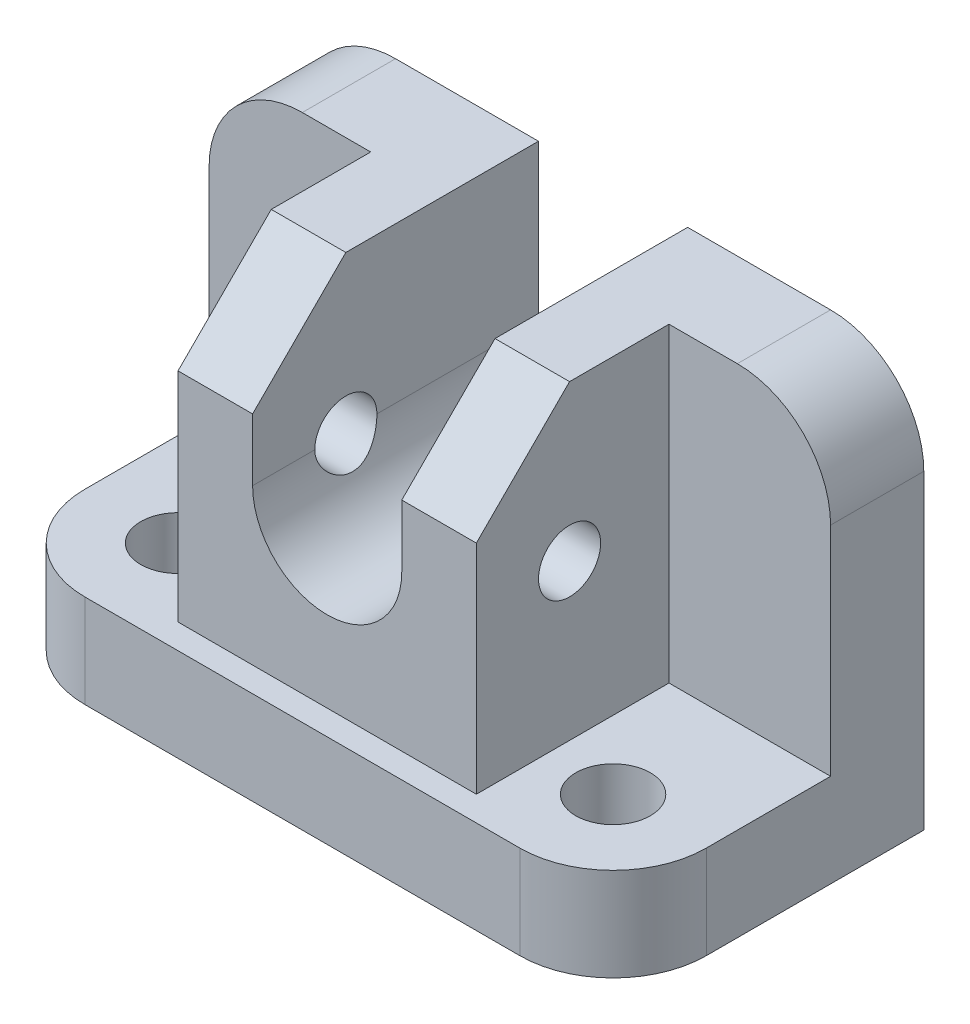
ISO-10303-21;
HEADER;
FILE_DESCRIPTION(('STEP AP214'),'2;1');
FILE_NAME('part.step','',(''),(''),'','','');
FILE_SCHEMA(('AUTOMOTIVE_DESIGN { 1 0 10303 214 1 1 1 1 }'));
ENDSEC;
DATA;
#1=APPLICATION_CONTEXT('core data for automotive mechanical design processes');
#2=APPLICATION_PROTOCOL_DEFINITION('international standard','automotive_design',2000,#1);
#3=PRODUCT_CONTEXT('',#1,'mechanical');
#4=PRODUCT('Part','Part','',(#3));
#5=PRODUCT_RELATED_PRODUCT_CATEGORY('part','',(#4));
#6=PRODUCT_DEFINITION_FORMATION('','',#4);
#7=PRODUCT_DEFINITION_CONTEXT('part definition',#1,'design');
#8=PRODUCT_DEFINITION('design','',#6,#7);
#9=PRODUCT_DEFINITION_SHAPE('','',#8);
#10=(LENGTH_UNIT() NAMED_UNIT(*) SI_UNIT(.MILLI.,.METRE.));
#11=(NAMED_UNIT(*) PLANE_ANGLE_UNIT() SI_UNIT($,.RADIAN.));
#12=(NAMED_UNIT(*) SI_UNIT($,.STERADIAN.) SOLID_ANGLE_UNIT());
#13=UNCERTAINTY_MEASURE_WITH_UNIT(LENGTH_MEASURE(1.E-05),#10,'distance_accuracy_value','');
#14=(GEOMETRIC_REPRESENTATION_CONTEXT(3) GLOBAL_UNCERTAINTY_ASSIGNED_CONTEXT((#13)) GLOBAL_UNIT_ASSIGNED_CONTEXT((#10,
#11,#12)) REPRESENTATION_CONTEXT('',''));
#15=CARTESIAN_POINT('',(0.,0.,0.));
#16=DIRECTION('',(0.,0.,1.));
#17=DIRECTION('',(1.,0.,0.));
#18=AXIS2_PLACEMENT_3D('',#15,#16,#17);
#19=CARTESIAN_POINT('',(0.,0.,46.));
#20=DIRECTION('',(0.,0.,-1.));
#21=DIRECTION('',(-1.,0.,0.));
#22=AXIS2_PLACEMENT_3D('',#19,#20,#21);
#23=PLANE('',#22);
#24=DIRECTION('',(0.,1.,0.));
#25=VECTOR('',#24,1.);
#26=CARTESIAN_POINT('',(24.,15.,46.));
#27=LINE('',#26,#25);
#28=CARTESIAN_POINT('',(24.,15.,46.));
#29=VERTEX_POINT('',#28);
#30=CARTESIAN_POINT('',(24.,50.,46.));
#31=VERTEX_POINT('',#30);
#32=EDGE_CURVE('E557',#29,#31,#27,.T.);
#33=ORIENTED_EDGE('',*,*,#32,.T.);
#34=DIRECTION('',(-1.,0.,0.));
#35=VECTOR('',#34,1.);
#36=CARTESIAN_POINT('',(50.,50.,46.));
#37=LINE('',#36,#35);
#38=CARTESIAN_POINT('',(12.,50.,46.));
#39=VERTEX_POINT('',#38);
#40=EDGE_CURVE('E509',#31,#39,#37,.T.);
#41=ORIENTED_EDGE('',*,*,#40,.T.);
#42=DIRECTION('',(0.,1.,0.));
#43=VECTOR('',#42,1.);
#44=CARTESIAN_POINT('',(12.,65.,46.));
#45=LINE('',#44,#43);
#46=CARTESIAN_POINT('',(12.,40.,46.));
#47=VERTEX_POINT('',#46);
#48=EDGE_CURVE('E529',#47,#39,#45,.T.);
#49=ORIENTED_EDGE('',*,*,#48,.F.);
#50=CARTESIAN_POINT('',(0.,40.,46.));
#51=DIRECTION('',(0.,0.,1.));
#52=DIRECTION('',(-1.,0.,0.));
#53=AXIS2_PLACEMENT_3D('',#50,#51,#52);
#54=CIRCLE('',#53,12.);
#55=CARTESIAN_POINT('',(-12.,40.,46.));
#56=VERTEX_POINT('',#55);
#57=EDGE_CURVE('E538',#56,#47,#54,.T.);
#58=ORIENTED_EDGE('',*,*,#57,.F.);
#59=DIRECTION('',(0.,-1.,0.));
#60=VECTOR('',#59,1.);
#61=CARTESIAN_POINT('',(-12.,65.,46.));
#62=LINE('',#61,#60);
#63=CARTESIAN_POINT('',(-12.,50.,46.));
#64=VERTEX_POINT('',#63);
#65=EDGE_CURVE('E209',#64,#56,#62,.T.);
#66=ORIENTED_EDGE('',*,*,#65,.F.);
#67=DIRECTION('',(1.,0.,0.));
#68=VECTOR('',#67,1.);
#69=CARTESIAN_POINT('',(-50.,50.,46.));
#70=LINE('',#69,#68);
#71=CARTESIAN_POINT('',(-24.,50.,46.));
#72=VERTEX_POINT('',#71);
#73=EDGE_CURVE('E518',#72,#64,#70,.T.);
#74=ORIENTED_EDGE('',*,*,#73,.F.);
#75=DIRECTION('',(0.,1.,0.));
#76=VECTOR('',#75,1.);
#77=CARTESIAN_POINT('',(-24.,15.,46.));
#78=LINE('',#77,#76);
#79=CARTESIAN_POINT('',(-24.,15.,46.));
#80=VERTEX_POINT('',#79);
#81=EDGE_CURVE('E489',#80,#72,#78,.T.);
#82=ORIENTED_EDGE('',*,*,#81,.F.);
#83=DIRECTION('',(1.,0.,0.));
#84=VECTOR('',#83,1.);
#85=CARTESIAN_POINT('',(0.,15.,46.));
#86=LINE('',#85,#84);
#87=EDGE_CURVE('E227',#80,#29,#86,.T.);
#88=ORIENTED_EDGE('',*,*,#87,.T.);
#89=EDGE_LOOP('',(#33,#41,#49,#58,#66,#74,#82,#88));
#90=FACE_BOUND('',#89,.T.);
#91=ADVANCED_FACE('F39',(#90),#23,.F.);
#92=CARTESIAN_POINT('',(-50.,65.,46.));
#93=DIRECTION('',(0.,-1.,0.));
#94=DIRECTION('',(0.,0.,-1.));
#95=AXIS2_PLACEMENT_3D('',#92,#93,#94);
#96=PLANE('',#95);
#97=DIRECTION('',(1.,0.,0.));
#98=VECTOR('',#97,1.);
#99=CARTESIAN_POINT('',(24.,65.,15.));
#100=LINE('',#99,#98);
#101=CARTESIAN_POINT('',(24.,65.,15.));
#102=VERTEX_POINT('',#101);
#103=CARTESIAN_POINT('',(35.,65.,15.));
#104=VERTEX_POINT('',#103);
#105=EDGE_CURVE('E468',#102,#104,#100,.T.);
#106=ORIENTED_EDGE('',*,*,#105,.T.);
#107=DIRECTION('',(0.,0.,-1.));
#108=VECTOR('',#107,1.);
#109=CARTESIAN_POINT('',(35.,65.,46.));
#110=LINE('',#109,#108);
#111=CARTESIAN_POINT('',(35.,65.,0.));
#112=VERTEX_POINT('',#111);
#113=EDGE_CURVE('E291',#104,#112,#110,.T.);
#114=ORIENTED_EDGE('',*,*,#113,.T.);
#115=DIRECTION('',(-1.,0.,0.));
#116=VECTOR('',#115,1.);
#117=CARTESIAN_POINT('',(-50.,65.,0.));
#118=LINE('',#117,#116);
#119=CARTESIAN_POINT('',(12.,65.,0.));
#120=VERTEX_POINT('',#119);
#121=EDGE_CURVE('E224',#112,#120,#118,.T.);
#122=ORIENTED_EDGE('',*,*,#121,.T.);
#123=DIRECTION('',(0.,0.,1.));
#124=VECTOR('',#123,1.);
#125=CARTESIAN_POINT('',(12.,65.,0.));
#126=LINE('',#125,#124);
#127=CARTESIAN_POINT('',(12.,65.,31.));
#128=VERTEX_POINT('',#127);
#129=EDGE_CURVE('E543',#120,#128,#126,.T.);
#130=ORIENTED_EDGE('',*,*,#129,.T.);
#131=DIRECTION('',(-1.,0.,0.));
#132=VECTOR('',#131,1.);
#133=CARTESIAN_POINT('',(50.,65.,31.));
#134=LINE('',#133,#132);
#135=CARTESIAN_POINT('',(24.,65.,31.));
#136=VERTEX_POINT('',#135);
#137=EDGE_CURVE('E508',#136,#128,#134,.T.);
#138=ORIENTED_EDGE('',*,*,#137,.F.);
#139=DIRECTION('',(0.,0.,-1.));
#140=VECTOR('',#139,1.);
#141=CARTESIAN_POINT('',(24.,65.,31.));
#142=LINE('',#141,#140);
#143=EDGE_CURVE('E461',#136,#102,#142,.T.);
#144=ORIENTED_EDGE('',*,*,#143,.T.);
#145=EDGE_LOOP('',(#106,#114,#122,#130,#138,#144));
#146=FACE_BOUND('',#145,.T.);
#147=ADVANCED_FACE('F395',(#146),#96,.F.);
#148=CARTESIAN_POINT('',(50.,15.,0.));
#149=DIRECTION('',(-1.,0.,0.));
#150=DIRECTION('',(0.,0.,1.));
#151=AXIS2_PLACEMENT_3D('',#148,#149,#150);
#152=PLANE('',#151);
#153=DIRECTION('',(0.,0.,-1.));
#154=VECTOR('',#153,1.);
#155=CARTESIAN_POINT('',(50.,15.,0.));
#156=LINE('',#155,#154);
#157=CARTESIAN_POINT('',(50.,15.,35.));
#158=VERTEX_POINT('',#157);
#159=CARTESIAN_POINT('',(50.,15.,15.));
#160=VERTEX_POINT('',#159);
#161=EDGE_CURVE('E242',#158,#160,#156,.T.);
#162=ORIENTED_EDGE('',*,*,#161,.F.);
#163=DIRECTION('',(0.,-1.,0.));
#164=VECTOR('',#163,1.);
#165=CARTESIAN_POINT('',(50.,15.,35.));
#166=LINE('',#165,#164);
#167=CARTESIAN_POINT('',(50.,0.,35.));
#168=VERTEX_POINT('',#167);
#169=EDGE_CURVE('E268',#158,#168,#166,.T.);
#170=ORIENTED_EDGE('',*,*,#169,.T.);
#171=DIRECTION('',(0.,0.,-1.));
#172=VECTOR('',#171,1.);
#173=CARTESIAN_POINT('',(50.,0.,0.));
#174=LINE('',#173,#172);
#175=CARTESIAN_POINT('',(50.,0.,0.));
#176=VERTEX_POINT('',#175);
#177=EDGE_CURVE('E253',#168,#176,#174,.T.);
#178=ORIENTED_EDGE('',*,*,#177,.T.);
#179=DIRECTION('',(0.,-1.,0.));
#180=VECTOR('',#179,1.);
#181=CARTESIAN_POINT('',(50.,15.,0.));
#182=LINE('',#181,#180);
#183=CARTESIAN_POINT('',(50.,50.,0.));
#184=VERTEX_POINT('',#183);
#185=EDGE_CURVE('E262',#184,#176,#182,.T.);
#186=ORIENTED_EDGE('',*,*,#185,.F.);
#187=DIRECTION('',(0.,0.,-1.));
#188=VECTOR('',#187,1.);
#189=CARTESIAN_POINT('',(50.,50.,0.));
#190=LINE('',#189,#188);
#191=CARTESIAN_POINT('',(50.,50.,15.));
#192=VERTEX_POINT('',#191);
#193=EDGE_CURVE('E265',#184,#192,#190,.F.);
#194=ORIENTED_EDGE('',*,*,#193,.T.);
#195=DIRECTION('',(0.,-1.,0.));
#196=VECTOR('',#195,1.);
#197=CARTESIAN_POINT('',(50.,65.,15.));
#198=LINE('',#197,#196);
#199=EDGE_CURVE('E455',#192,#160,#198,.T.);
#200=ORIENTED_EDGE('',*,*,#199,.T.);
#201=EDGE_LOOP('',(#162,#170,#178,#186,#194,#200));
#202=FACE_BOUND('',#201,.T.);
#203=ADVANCED_FACE('F379',(#202),#152,.F.);
#204=CARTESIAN_POINT('',(50.,65.,31.));
#205=DIRECTION('',(0.,0.707106781186548,0.707106781186548));
#206=DIRECTION('',(0.,-0.707106781186548,0.707106781186548));
#207=AXIS2_PLACEMENT_3D('',#204,#205,#206);
#208=PLANE('',#207);
#209=ORIENTED_EDGE('',*,*,#40,.F.);
#210=DIRECTION('',(0.,0.707106781186548,-0.707106781186547));
#211=VECTOR('',#210,1.);
#212=CARTESIAN_POINT('',(24.,50.,46.));
#213=LINE('',#212,#211);
#214=EDGE_CURVE('E567',#31,#136,#213,.T.);
#215=ORIENTED_EDGE('',*,*,#214,.T.);
#216=ORIENTED_EDGE('',*,*,#137,.T.);
#217=DIRECTION('',(0.,0.707106781186547,-0.707106781186547));
#218=VECTOR('',#217,1.);
#219=CARTESIAN_POINT('',(12.,65.,31.));
#220=LINE('',#219,#218);
#221=EDGE_CURVE('E501',#39,#128,#220,.T.);
#222=ORIENTED_EDGE('',*,*,#221,.F.);
#223=EDGE_LOOP('',(#209,#215,#216,#222));
#224=FACE_BOUND('',#223,.T.);
#225=ADVANCED_FACE('F375',(#224),#208,.T.);
#226=CARTESIAN_POINT('',(-50.,65.,31.));
#227=DIRECTION('',(0.,-0.707106781186548,-0.707106781186548));
#228=DIRECTION('',(0.,0.707106781186548,-0.707106781186548));
#229=AXIS2_PLACEMENT_3D('',#226,#227,#228);
#230=PLANE('',#229);
#231=DIRECTION('',(0.,0.707106781186548,-0.707106781186547));
#232=VECTOR('',#231,1.);
#233=CARTESIAN_POINT('',(-24.,50.,46.));
#234=LINE('',#233,#232);
#235=CARTESIAN_POINT('',(-24.,65.,31.));
#236=VERTEX_POINT('',#235);
#237=EDGE_CURVE('E492',#72,#236,#234,.T.);
#238=ORIENTED_EDGE('',*,*,#237,.F.);
#239=ORIENTED_EDGE('',*,*,#73,.T.);
#240=DIRECTION('',(0.,0.707106781186547,-0.707106781186547));
#241=VECTOR('',#240,1.);
#242=CARTESIAN_POINT('',(-12.,65.,31.));
#243=LINE('',#242,#241);
#244=CARTESIAN_POINT('',(-12.,65.,31.));
#245=VERTEX_POINT('',#244);
#246=EDGE_CURVE('E512',#64,#245,#243,.T.);
#247=ORIENTED_EDGE('',*,*,#246,.T.);
#248=DIRECTION('',(1.,0.,0.));
#249=VECTOR('',#248,1.);
#250=CARTESIAN_POINT('',(-50.,65.,31.));
#251=LINE('',#250,#249);
#252=EDGE_CURVE('E519',#236,#245,#251,.T.);
#253=ORIENTED_EDGE('',*,*,#252,.F.);
#254=EDGE_LOOP('',(#238,#239,#247,#253));
#255=FACE_BOUND('',#254,.T.);
#256=ADVANCED_FACE('F378',(#255),#230,.F.);
#257=CARTESIAN_POINT('',(12.,65.,0.));
#258=DIRECTION('',(1.,0.,0.));
#259=DIRECTION('',(0.,1.,0.));
#260=AXIS2_PLACEMENT_3D('',#257,#258,#259);
#261=PLANE('',#260);
#262=DIRECTION('',(0.,0.,1.));
#263=VECTOR('',#262,1.);
#264=CARTESIAN_POINT('',(12.,40.,0.));
#265=LINE('',#264,#263);
#266=CARTESIAN_POINT('',(12.,40.,0.));
#267=VERTEX_POINT('',#266);
#268=CARTESIAN_POINT('',(12.,40.,26.));
#269=VERTEX_POINT('',#268);
#270=EDGE_CURVE('E221',#267,#269,#265,.T.);
#271=ORIENTED_EDGE('',*,*,#270,.T.);
#272=CARTESIAN_POINT('',(12.,40.,31.));
#273=DIRECTION('',(1.,0.,0.));
#274=DIRECTION('',(0.,1.,0.));
#275=AXIS2_PLACEMENT_3D('',#272,#273,#274);
#276=CIRCLE('',#275,5.);
#277=CARTESIAN_POINT('',(12.,40.,36.));
#278=VERTEX_POINT('',#277);
#279=EDGE_CURVE('E56',#269,#278,#276,.T.);
#280=ORIENTED_EDGE('',*,*,#279,.T.);
#281=EDGE_CURVE('E216',#278,#47,#265,.T.);
#282=ORIENTED_EDGE('',*,*,#281,.T.);
#283=ORIENTED_EDGE('',*,*,#48,.T.);
#284=ORIENTED_EDGE('',*,*,#221,.T.);
#285=ORIENTED_EDGE('',*,*,#129,.F.);
#286=DIRECTION('',(0.,1.,0.));
#287=VECTOR('',#286,1.);
#288=CARTESIAN_POINT('',(12.,65.,0.));
#289=LINE('',#288,#287);
#290=EDGE_CURVE('E218',#267,#120,#289,.T.);
#291=ORIENTED_EDGE('',*,*,#290,.F.);
#292=EDGE_LOOP('',(#271,#280,#282,#283,#284,#285,#291));
#293=FACE_BOUND('',#292,.T.);
#294=ADVANCED_FACE('F382',(#293),#261,.F.);
#295=CARTESIAN_POINT('',(0.,15.,0.));
#296=DIRECTION('',(0.,-1.,0.));
#297=DIRECTION('',(0.,0.,-1.));
#298=AXIS2_PLACEMENT_3D('',#295,#296,#297);
#299=PLANE('',#298);
#300=CARTESIAN_POINT('',(35.,15.,35.));
#301=DIRECTION('',(0.,-1.,0.));
#302=DIRECTION('',(0.,0.,1.));
#303=AXIS2_PLACEMENT_3D('',#300,#301,#302);
#304=CIRCLE('',#303,6.);
#305=CARTESIAN_POINT('',(35.,15.,41.));
#306=VERTEX_POINT('',#305);
#307=EDGE_CURVE('E329',#306,#306,#304,.T.);
#308=ORIENTED_EDGE('',*,*,#307,.T.);
#309=EDGE_LOOP('',(#308));
#310=FACE_BOUND('',#309,.T.);
#311=CARTESIAN_POINT('',(-35.,15.,35.));
#312=DIRECTION('',(0.,1.,0.));
#313=DIRECTION('',(0.,0.,1.));
#314=AXIS2_PLACEMENT_3D('',#311,#312,#313);
#315=CIRCLE('',#314,6.);
#316=CARTESIAN_POINT('',(-35.,15.,41.));
#317=VERTEX_POINT('',#316);
#318=EDGE_CURVE('E316',#317,#317,#315,.T.);
#319=ORIENTED_EDGE('',*,*,#318,.F.);
#320=EDGE_LOOP('',(#319));
#321=FACE_BOUND('',#320,.T.);
#322=DIRECTION('',(1.,0.,0.));
#323=VECTOR('',#322,1.);
#324=CARTESIAN_POINT('',(50.,15.,50.));
#325=LINE('',#324,#323);
#326=CARTESIAN_POINT('',(-35.,15.,50.));
#327=VERTEX_POINT('',#326);
#328=CARTESIAN_POINT('',(35.,15.,50.));
#329=VERTEX_POINT('',#328);
#330=EDGE_CURVE('E237',#327,#329,#325,.T.);
#331=ORIENTED_EDGE('',*,*,#330,.T.);
#332=CARTESIAN_POINT('',(35.,15.,35.));
#333=DIRECTION('',(0.,-1.,0.));
#334=DIRECTION('',(0.,0.,-1.));
#335=AXIS2_PLACEMENT_3D('',#332,#333,#334);
#336=CIRCLE('',#335,15.);
#337=EDGE_CURVE('E288',#329,#158,#336,.F.);
#338=ORIENTED_EDGE('',*,*,#337,.T.);
#339=ORIENTED_EDGE('',*,*,#161,.T.);
#340=DIRECTION('',(1.,0.,0.));
#341=VECTOR('',#340,1.);
#342=CARTESIAN_POINT('',(24.,15.,15.));
#343=LINE('',#342,#341);
#344=CARTESIAN_POINT('',(24.,15.,15.));
#345=VERTEX_POINT('',#344);
#346=EDGE_CURVE('E463',#345,#160,#343,.T.);
#347=ORIENTED_EDGE('',*,*,#346,.F.);
#348=DIRECTION('',(0.,0.,1.));
#349=VECTOR('',#348,1.);
#350=CARTESIAN_POINT('',(24.,15.,15.));
#351=LINE('',#350,#349);
#352=EDGE_CURVE('E475',#345,#29,#351,.T.);
#353=ORIENTED_EDGE('',*,*,#352,.T.);
#354=ORIENTED_EDGE('',*,*,#87,.F.);
#355=DIRECTION('',(0.,0.,1.));
#356=VECTOR('',#355,1.);
#357=CARTESIAN_POINT('',(-24.,15.,15.));
#358=LINE('',#357,#356);
#359=CARTESIAN_POINT('',(-24.,15.,15.));
#360=VERTEX_POINT('',#359);
#361=EDGE_CURVE('E486',#360,#80,#358,.T.);
#362=ORIENTED_EDGE('',*,*,#361,.F.);
#363=DIRECTION('',(-1.,0.,0.));
#364=VECTOR('',#363,1.);
#365=CARTESIAN_POINT('',(-24.,15.,15.));
#366=LINE('',#365,#364);
#367=CARTESIAN_POINT('',(-50.,15.,15.));
#368=VERTEX_POINT('',#367);
#369=EDGE_CURVE('E498',#360,#368,#366,.T.);
#370=ORIENTED_EDGE('',*,*,#369,.T.);
#371=DIRECTION('',(0.,0.,1.));
#372=VECTOR('',#371,1.);
#373=CARTESIAN_POINT('',(-50.,15.,50.));
#374=LINE('',#373,#372);
#375=CARTESIAN_POINT('',(-50.,15.,35.));
#376=VERTEX_POINT('',#375);
#377=EDGE_CURVE('E233',#368,#376,#374,.T.);
#378=ORIENTED_EDGE('',*,*,#377,.T.);
#379=CARTESIAN_POINT('',(-35.,15.,35.));
#380=DIRECTION('',(0.,-1.,0.));
#381=DIRECTION('',(0.,0.,-1.));
#382=AXIS2_PLACEMENT_3D('',#379,#380,#381);
#383=CIRCLE('',#382,15.);
#384=EDGE_CURVE('E285',#376,#327,#383,.F.);
#385=ORIENTED_EDGE('',*,*,#384,.T.);
#386=EDGE_LOOP('',(#331,#338,#339,#347,#353,#354,#362,#370,#378,#385));
#387=FACE_BOUND('',#386,.T.);
#388=ADVANCED_FACE('F385',(#310,#321,#387),#299,.F.);
#389=CARTESIAN_POINT('',(-50.,15.,50.));
#390=DIRECTION('',(1.,0.,0.));
#391=DIRECTION('',(0.,0.,-1.));
#392=AXIS2_PLACEMENT_3D('',#389,#390,#391);
#393=PLANE('',#392);
#394=DIRECTION('',(0.,0.,1.));
#395=VECTOR('',#394,1.);
#396=CARTESIAN_POINT('',(-50.,0.,50.));
#397=LINE('',#396,#395);
#398=CARTESIAN_POINT('',(-50.,0.,0.));
#399=VERTEX_POINT('',#398);
#400=CARTESIAN_POINT('',(-50.,0.,35.));
#401=VERTEX_POINT('',#400);
#402=EDGE_CURVE('E232',#399,#401,#397,.T.);
#403=ORIENTED_EDGE('',*,*,#402,.T.);
#404=DIRECTION('',(0.,-1.,0.));
#405=VECTOR('',#404,1.);
#406=CARTESIAN_POINT('',(-50.,15.,35.));
#407=LINE('',#406,#405);
#408=EDGE_CURVE('E308',#401,#376,#407,.F.);
#409=ORIENTED_EDGE('',*,*,#408,.T.);
#410=ORIENTED_EDGE('',*,*,#377,.F.);
#411=DIRECTION('',(0.,-1.,0.));
#412=VECTOR('',#411,1.);
#413=CARTESIAN_POINT('',(-50.,65.,15.));
#414=LINE('',#413,#412);
#415=CARTESIAN_POINT('',(-50.,50.,15.));
#416=VERTEX_POINT('',#415);
#417=EDGE_CURVE('E473',#416,#368,#414,.T.);
#418=ORIENTED_EDGE('',*,*,#417,.F.);
#419=DIRECTION('',(0.,0.,-1.));
#420=VECTOR('',#419,1.);
#421=CARTESIAN_POINT('',(-50.,50.,50.));
#422=LINE('',#421,#420);
#423=CARTESIAN_POINT('',(-50.,50.,0.));
#424=VERTEX_POINT('',#423);
#425=EDGE_CURVE('E304',#416,#424,#422,.T.);
#426=ORIENTED_EDGE('',*,*,#425,.T.);
#427=DIRECTION('',(0.,-1.,0.));
#428=VECTOR('',#427,1.);
#429=CARTESIAN_POINT('',(-50.,15.,0.));
#430=LINE('',#429,#428);
#431=EDGE_CURVE('E245',#424,#399,#430,.T.);
#432=ORIENTED_EDGE('',*,*,#431,.T.);
#433=EDGE_LOOP('',(#403,#409,#410,#418,#426,#432));
#434=FACE_BOUND('',#433,.T.);
#435=ADVANCED_FACE('F390',(#434),#393,.F.);
#436=CARTESIAN_POINT('',(50.,15.,50.));
#437=DIRECTION('',(0.,0.,-1.));
#438=DIRECTION('',(-1.,0.,0.));
#439=AXIS2_PLACEMENT_3D('',#436,#437,#438);
#440=PLANE('',#439);
#441=DIRECTION('',(1.,0.,0.));
#442=VECTOR('',#441,1.);
#443=CARTESIAN_POINT('',(50.,0.,50.));
#444=LINE('',#443,#442);
#445=CARTESIAN_POINT('',(-35.,0.,50.));
#446=VERTEX_POINT('',#445);
#447=CARTESIAN_POINT('',(35.,0.,50.));
#448=VERTEX_POINT('',#447);
#449=EDGE_CURVE('E249',#446,#448,#444,.T.);
#450=ORIENTED_EDGE('',*,*,#449,.T.);
#451=DIRECTION('',(0.,-1.,0.));
#452=VECTOR('',#451,1.);
#453=CARTESIAN_POINT('',(35.,15.,50.));
#454=LINE('',#453,#452);
#455=EDGE_CURVE('E282',#448,#329,#454,.F.);
#456=ORIENTED_EDGE('',*,*,#455,.T.);
#457=ORIENTED_EDGE('',*,*,#330,.F.);
#458=DIRECTION('',(0.,-1.,0.));
#459=VECTOR('',#458,1.);
#460=CARTESIAN_POINT('',(-35.,15.,50.));
#461=LINE('',#460,#459);
#462=EDGE_CURVE('E278',#327,#446,#461,.T.);
#463=ORIENTED_EDGE('',*,*,#462,.T.);
#464=EDGE_LOOP('',(#450,#456,#457,#463));
#465=FACE_BOUND('',#464,.T.);
#466=ADVANCED_FACE('F415',(#465),#440,.F.);
#467=CARTESIAN_POINT('',(-50.,15.,0.));
#468=DIRECTION('',(0.,0.,1.));
#469=DIRECTION('',(1.,0.,0.));
#470=AXIS2_PLACEMENT_3D('',#467,#468,#469);
#471=PLANE('',#470);
#472=ORIENTED_EDGE('',*,*,#121,.F.);
#473=CARTESIAN_POINT('',(35.,50.,0.));
#474=DIRECTION('',(0.,0.,1.));
#475=DIRECTION('',(1.,0.,0.));
#476=AXIS2_PLACEMENT_3D('',#473,#474,#475);
#477=CIRCLE('',#476,15.);
#478=EDGE_CURVE('E298',#112,#184,#477,.F.);
#479=ORIENTED_EDGE('',*,*,#478,.T.);
#480=ORIENTED_EDGE('',*,*,#185,.T.);
#481=DIRECTION('',(-1.,0.,0.));
#482=VECTOR('',#481,1.);
#483=CARTESIAN_POINT('',(-50.,0.,0.));
#484=LINE('',#483,#482);
#485=EDGE_CURVE('E238',#176,#399,#484,.T.);
#486=ORIENTED_EDGE('',*,*,#485,.T.);
#487=ORIENTED_EDGE('',*,*,#431,.F.);
#488=CARTESIAN_POINT('',(-35.,50.,0.));
#489=DIRECTION('',(0.,0.,1.));
#490=DIRECTION('',(1.,0.,0.));
#491=AXIS2_PLACEMENT_3D('',#488,#489,#490);
#492=CIRCLE('',#491,15.);
#493=CARTESIAN_POINT('',(-35.,65.,0.));
#494=VERTEX_POINT('',#493);
#495=EDGE_CURVE('E295',#424,#494,#492,.F.);
#496=ORIENTED_EDGE('',*,*,#495,.T.);
#497=CARTESIAN_POINT('',(-12.,65.,0.));
#498=VERTEX_POINT('',#497);
#499=EDGE_CURVE('E228',#498,#494,#118,.T.);
#500=ORIENTED_EDGE('',*,*,#499,.F.);
#501=DIRECTION('',(0.,-1.,0.));
#502=VECTOR('',#501,1.);
#503=CARTESIAN_POINT('',(-12.,65.,0.));
#504=LINE('',#503,#502);
#505=CARTESIAN_POINT('',(-12.,40.,0.));
#506=VERTEX_POINT('',#505);
#507=EDGE_CURVE('E524',#498,#506,#504,.T.);
#508=ORIENTED_EDGE('',*,*,#507,.T.);
#509=CARTESIAN_POINT('',(0.,40.,0.));
#510=DIRECTION('',(0.,0.,1.));
#511=DIRECTION('',(1.,0.,0.));
#512=AXIS2_PLACEMENT_3D('',#509,#510,#511);
#513=CIRCLE('',#512,12.);
#514=EDGE_CURVE('E528',#506,#267,#513,.T.);
#515=ORIENTED_EDGE('',*,*,#514,.T.);
#516=ORIENTED_EDGE('',*,*,#290,.T.);
#517=EDGE_LOOP('',(#472,#479,#480,#486,#487,#496,#500,#508,#515,#516));
#518=FACE_BOUND('',#517,.T.);
#519=ADVANCED_FACE('F411',(#518),#471,.F.);
#520=CARTESIAN_POINT('',(0.,0.,0.));
#521=DIRECTION('',(0.,-1.,0.));
#522=DIRECTION('',(0.,0.,-1.));
#523=AXIS2_PLACEMENT_3D('',#520,#521,#522);
#524=PLANE('',#523);
#525=CARTESIAN_POINT('',(35.,0.,35.));
#526=DIRECTION('',(0.,-1.,0.));
#527=DIRECTION('',(0.,0.,-1.));
#528=AXIS2_PLACEMENT_3D('',#525,#526,#527);
#529=CIRCLE('',#528,6.);
#530=CARTESIAN_POINT('',(35.,0.,29.));
#531=VERTEX_POINT('',#530);
#532=EDGE_CURVE('E43',#531,#531,#529,.F.);
#533=ORIENTED_EDGE('',*,*,#532,.T.);
#534=EDGE_LOOP('',(#533));
#535=FACE_BOUND('',#534,.T.);
#536=CARTESIAN_POINT('',(-35.,0.,35.));
#537=DIRECTION('',(0.,-1.,0.));
#538=DIRECTION('',(0.,0.,-1.));
#539=AXIS2_PLACEMENT_3D('',#536,#537,#538);
#540=CIRCLE('',#539,6.);
#541=CARTESIAN_POINT('',(-35.,0.,29.));
#542=VERTEX_POINT('',#541);
#543=EDGE_CURVE('E312',#542,#542,#540,.T.);
#544=ORIENTED_EDGE('',*,*,#543,.F.);
#545=EDGE_LOOP('',(#544));
#546=FACE_BOUND('',#545,.T.);
#547=ORIENTED_EDGE('',*,*,#177,.F.);
#548=CARTESIAN_POINT('',(35.,0.,35.));
#549=DIRECTION('',(0.,-1.,0.));
#550=DIRECTION('',(0.,0.,-1.));
#551=AXIS2_PLACEMENT_3D('',#548,#549,#550);
#552=CIRCLE('',#551,15.);
#553=EDGE_CURVE('E275',#168,#448,#552,.T.);
#554=ORIENTED_EDGE('',*,*,#553,.T.);
#555=ORIENTED_EDGE('',*,*,#449,.F.);
#556=CARTESIAN_POINT('',(-35.,0.,35.));
#557=DIRECTION('',(0.,-1.,0.));
#558=DIRECTION('',(0.,0.,-1.));
#559=AXIS2_PLACEMENT_3D('',#556,#557,#558);
#560=CIRCLE('',#559,15.);
#561=EDGE_CURVE('E272',#446,#401,#560,.T.);
#562=ORIENTED_EDGE('',*,*,#561,.T.);
#563=ORIENTED_EDGE('',*,*,#402,.F.);
#564=ORIENTED_EDGE('',*,*,#485,.F.);
#565=EDGE_LOOP('',(#547,#554,#555,#562,#563,#564));
#566=FACE_BOUND('',#565,.T.);
#567=ADVANCED_FACE('F406',(#535,#546,#566),#524,.T.);
#568=ORIENTED_EDGE('',*,*,#499,.T.);
#569=DIRECTION('',(0.,0.,-1.));
#570=VECTOR('',#569,1.);
#571=CARTESIAN_POINT('',(-35.,65.,46.));
#572=LINE('',#571,#570);
#573=CARTESIAN_POINT('',(-35.,65.,15.));
#574=VERTEX_POINT('',#573);
#575=EDGE_CURVE('E49',#494,#574,#572,.F.);
#576=ORIENTED_EDGE('',*,*,#575,.T.);
#577=DIRECTION('',(-1.,0.,0.));
#578=VECTOR('',#577,1.);
#579=CARTESIAN_POINT('',(-24.,65.,15.));
#580=LINE('',#579,#578);
#581=CARTESIAN_POINT('',(-24.,65.,15.));
#582=VERTEX_POINT('',#581);
#583=EDGE_CURVE('E495',#582,#574,#580,.T.);
#584=ORIENTED_EDGE('',*,*,#583,.F.);
#585=DIRECTION('',(0.,0.,-1.));
#586=VECTOR('',#585,1.);
#587=CARTESIAN_POINT('',(-24.,65.,31.));
#588=LINE('',#587,#586);
#589=EDGE_CURVE('E478',#236,#582,#588,.T.);
#590=ORIENTED_EDGE('',*,*,#589,.F.);
#591=ORIENTED_EDGE('',*,*,#252,.T.);
#592=DIRECTION('',(0.,0.,1.));
#593=VECTOR('',#592,1.);
#594=CARTESIAN_POINT('',(-12.,65.,0.));
#595=LINE('',#594,#593);
#596=EDGE_CURVE('E212',#498,#245,#595,.T.);
#597=ORIENTED_EDGE('',*,*,#596,.F.);
#598=EDGE_LOOP('',(#568,#576,#584,#590,#591,#597));
#599=FACE_BOUND('',#598,.T.);
#600=ADVANCED_FACE('F403',(#599),#96,.F.);
#601=CARTESIAN_POINT('',(0.,40.,0.));
#602=DIRECTION('',(0.,0.,1.));
#603=DIRECTION('',(1.,0.,0.));
#604=AXIS2_PLACEMENT_3D('',#601,#602,#603);
#605=CYLINDRICAL_SURFACE('',#604,12.);
#606=ORIENTED_EDGE('',*,*,#281,.F.);
#607=CARTESIAN_POINT('',(12.,40.,36.));
#608=CARTESIAN_POINT('',(12.0000214258026,39.865508668788,36.0000205694111));
#609=CARTESIAN_POINT('',(11.9977397915025,39.731026960202,35.9945745427965));
#610=CARTESIAN_POINT('',(11.9887274459291,39.4631259350166,35.9729030960246));
#611=CARTESIAN_POINT('',(11.9819981296349,39.3297062985811,35.956681055668));
#612=CARTESIAN_POINT('',(11.9642793320564,39.0653651419535,35.9136889699657));
#613=CARTESIAN_POINT('',(11.9533053228026,38.9344363404699,35.8869572270426));
#614=CARTESIAN_POINT('',(11.9273901797255,38.6755045983991,35.8232239084657));
#615=CARTESIAN_POINT('',(11.9124488725243,38.5475017859484,35.7862218839792));
#616=CARTESIAN_POINT('',(11.8789937540352,38.2954017991873,35.7023366080285));
#617=CARTESIAN_POINT('',(11.8604836181734,38.1713007581925,35.6554635179262));
#618=CARTESIAN_POINT('',(11.8203432319861,37.9276173767833,35.5522267625521));
#619=CARTESIAN_POINT('',(11.7987118146494,37.8080367476969,35.4958595462112));
#620=CARTESIAN_POINT('',(11.7298827419939,37.457063962059,35.3131136912581));
#621=CARTESIAN_POINT('',(11.6787412237923,37.2333758271894,35.1730690180868));
#622=CARTESIAN_POINT('',(11.5683073166864,36.8021589092952,34.8534688027542));
#623=CARTESIAN_POINT('',(11.5087503880852,36.5958237892123,34.6724088776277));
#624=CARTESIAN_POINT('',(11.389295111056,36.2153298276167,34.2788850730538));
#625=CARTESIAN_POINT('',(11.32939663131,36.0411843621612,34.0664082043558));
#626=CARTESIAN_POINT('',(11.2426690561441,35.8035719968132,33.7222751212264));
#627=CARTESIAN_POINT('',(11.2136408796751,35.7268112138035,33.6001401477096));
#628=CARTESIAN_POINT('',(11.158141537933,35.5839223345123,33.3492687619752));
#629=CARTESIAN_POINT('',(11.1316693164676,35.5177898387529,33.2205351104737));
#630=CARTESIAN_POINT('',(11.0821559043409,35.3967289337909,32.9572670469017));
#631=CARTESIAN_POINT('',(11.0591147913871,35.3418007783334,32.8227325035417));
#632=CARTESIAN_POINT('',(11.0172896903597,35.2437228601284,32.548859828042));
#633=CARTESIAN_POINT('',(10.9985035205551,35.2005670587511,32.4095242000889));
#634=CARTESIAN_POINT('',(10.9666621154017,35.1282643363255,32.1338094785444));
#635=CARTESIAN_POINT('',(10.9533761957664,35.0985472261888,31.9976065518035));
#636=CARTESIAN_POINT('',(10.9317792147046,35.0505658764243,31.7228664476652));
#637=CARTESIAN_POINT('',(10.9234658546777,35.0322963448874,31.5843303792761));
#638=CARTESIAN_POINT('',(10.9121185052144,35.007419740407,31.3060315355706));
#639=CARTESIAN_POINT('',(10.909083265221,35.0008099049,31.1662690587192));
#640=CARTESIAN_POINT('',(10.9084051977001,34.999330237288,30.8866726486004));
#641=CARTESIAN_POINT('',(10.9107620863752,35.0044597873181,30.7468387194809));
#642=CARTESIAN_POINT('',(10.9203897759689,35.0255447185351,30.4790134938313));
#643=CARTESIAN_POINT('',(10.9272684622831,35.040636605301,30.3509389666262));
#644=CARTESIAN_POINT('',(10.9453207082306,35.0806062369273,30.0965929916736));
#645=CARTESIAN_POINT('',(10.9564956721212,35.1054871814466,29.9703221474783));
#646=CARTESIAN_POINT('',(10.982792093585,35.1647824865194,29.7204901881177));
#647=CARTESIAN_POINT('',(10.9979125809821,35.199194503578,29.5969284148968));
#648=CARTESIAN_POINT('',(11.0316487627949,35.2772333201137,29.3532235526155));
#649=CARTESIAN_POINT('',(11.050265804508,35.3208636724254,29.2330818019813));
#650=CARTESIAN_POINT('',(11.1114346242678,35.4670773663438,28.8739146605738));
#651=CARTESIAN_POINT('',(11.1587349192086,35.5837652800017,28.6412612927456));
#652=CARTESIAN_POINT('',(11.2607362562223,35.8507626280133,28.1980519355816));
#653=CARTESIAN_POINT('',(11.3154403106641,36.0010857638834,27.9875050029384));
#654=CARTESIAN_POINT('',(11.4317132974399,36.3459920593695,27.5756283076919));
#655=CARTESIAN_POINT('',(11.493471834918,36.5432408655774,27.376578425262));
#656=CARTESIAN_POINT('',(11.61302750478,36.9691025286912,27.013539072013));
#657=CARTESIAN_POINT('',(11.6708232922775,37.1977259553421,26.8495614644703));
#658=CARTESIAN_POINT('',(11.7505785611735,37.5627830402626,26.6318464859427));
#659=CARTESIAN_POINT('',(11.7762704051548,37.6898107291073,26.5633428841786));
#660=CARTESIAN_POINT('',(11.8243038363053,37.9498113621461,26.4373735599982));
#661=CARTESIAN_POINT('',(11.8466468621269,38.0827817213133,26.379903094749));
#662=CARTESIAN_POINT('',(11.8873085083892,38.3536017885679,26.2766158876277));
#663=CARTESIAN_POINT('',(11.9056314041772,38.491446130248,26.2307867571066));
#664=CARTESIAN_POINT('',(11.9377325385643,38.77103749804,26.1512090780946));
#665=CARTESIAN_POINT('',(11.9515126724659,38.9127828697765,26.1174554910192));
#666=CARTESIAN_POINT('',(11.9750500481709,39.2111229621196,26.0601000322815));
#667=CARTESIAN_POINT('',(11.9843714994487,39.3679639734209,26.0375906551682));
#668=CARTESIAN_POINT('',(11.9968650984818,39.6831994344542,26.0075256700055));
#669=CARTESIAN_POINT('',(12.0000415899027,39.8415927072866,25.9999594990269));
#670=CARTESIAN_POINT('',(12.,40.,26.));
#671=B_SPLINE_CURVE_WITH_KNOTS('',3,(#607,#608,#609,#610,#611,#612,#613,#614,#615,#616,#617,
#618,#619,#620,#621,#622,#623,#624,#625,#626,#627,#628,#629,#630,#631,#632,#633,#634,#635,#636,
#637,#638,#639,#640,#641,#642,#643,#644,#645,#646,#647,#648,#649,#650,#651,#652,#653,#654,#655,
#656,#657,#658,#659,#660,#661,#662,#663,#664,#665,#666,#667,#668,#669,#670),.UNSPECIFIED.,.F.,
.F.,(4,2,2,2,2,2,2,2,2,2,2,2,2,2,2,2,2,2,2,2,2,2,2,2,2,2,2,2,2,2,2,4),(0.,0.403329377404146,
0.806532313827199,1.20827920685766,1.61004365982752,2.01139653709003,2.41289986628398,
3.21570124459116,4.05492715798719,4.89450102234779,5.33547884245322,5.7762736512109,
6.21707844155308,6.65765669404297,7.07721235018554,7.49657391361428,7.91583610321373,
8.33507622679917,8.72205318456406,9.10915673514156,9.49616518927501,9.88332307315087,
10.6733191945042,11.4636377134524,12.3206970609086,13.1780458537553,13.6173407462419,
14.0564463733646,14.4950827300889,14.9335358494153,15.4088629473943,15.8838539296877),.UNSPECIFIED.);
#672=EDGE_CURVE('E204',#278,#269,#671,.T.);
#673=ORIENTED_EDGE('',*,*,#672,.T.);
#674=ORIENTED_EDGE('',*,*,#270,.F.);
#675=ORIENTED_EDGE('',*,*,#514,.F.);
#676=DIRECTION('',(0.,0.,1.));
#677=VECTOR('',#676,1.);
#678=CARTESIAN_POINT('',(-12.,40.,0.));
#679=LINE('',#678,#677);
#680=CARTESIAN_POINT('',(-12.,40.,26.));
#681=VERTEX_POINT('',#680);
#682=EDGE_CURVE('E202',#506,#681,#679,.T.);
#683=ORIENTED_EDGE('',*,*,#682,.T.);
#684=CARTESIAN_POINT('',(-12.,40.,26.));
#685=CARTESIAN_POINT('',(-12.0000214258026,39.865508668788,25.9999794305889));
#686=CARTESIAN_POINT('',(-11.9977397915025,39.731026960202,26.0054254572035));
#687=CARTESIAN_POINT('',(-11.988727445929,39.4631259350166,26.0270969039754));
#688=CARTESIAN_POINT('',(-11.9819981296349,39.3297062985811,26.043318944332));
#689=CARTESIAN_POINT('',(-11.9642793320564,39.0653651419535,26.0863110300343));
#690=CARTESIAN_POINT('',(-11.9533053228026,38.9344363404699,26.1130427729574));
#691=CARTESIAN_POINT('',(-11.9273901797255,38.6755045983991,26.1767760915343));
#692=CARTESIAN_POINT('',(-11.9124488725243,38.5475017859484,26.2137781160208));
#693=CARTESIAN_POINT('',(-11.8789937540352,38.2954017991873,26.2976633919715));
#694=CARTESIAN_POINT('',(-11.8604836181734,38.1713007581924,26.3445364820738));
#695=CARTESIAN_POINT('',(-11.8203432319861,37.9276173767833,26.4477732374479));
#696=CARTESIAN_POINT('',(-11.7987118146494,37.8080367476969,26.5041404537888));
#697=CARTESIAN_POINT('',(-11.7298827419939,37.457063962059,26.6868863087419));
#698=CARTESIAN_POINT('',(-11.6787412237923,37.2333758271894,26.8269309819132));
#699=CARTESIAN_POINT('',(-11.5683073166863,36.8021589092952,27.1465311972458));
#700=CARTESIAN_POINT('',(-11.5087503880852,36.5958237892123,27.3275911223723));
#701=CARTESIAN_POINT('',(-11.389295111056,36.2153298276167,27.7211149269462));
#702=CARTESIAN_POINT('',(-11.32939663131,36.0411843621612,27.9335917956442));
#703=CARTESIAN_POINT('',(-11.2426690561441,35.8035719968132,28.2777248787736));
#704=CARTESIAN_POINT('',(-11.2136408796751,35.7268112138035,28.3998598522904));
#705=CARTESIAN_POINT('',(-11.158141537933,35.5839223345123,28.6507312380248));
#706=CARTESIAN_POINT('',(-11.1316693164676,35.5177898387529,28.7794648895263));
#707=CARTESIAN_POINT('',(-11.0821559043409,35.3967289337909,29.0427329530983));
#708=CARTESIAN_POINT('',(-11.0591147913871,35.3418007783334,29.1772674964583));
#709=CARTESIAN_POINT('',(-11.0172896903597,35.2437228601284,29.451140171958));
#710=CARTESIAN_POINT('',(-10.9985035205551,35.2005670587511,29.5904757999111));
#711=CARTESIAN_POINT('',(-10.9666621154017,35.1282643363255,29.8661905214556));
#712=CARTESIAN_POINT('',(-10.9533761957664,35.0985472261888,30.0023934481965));
#713=CARTESIAN_POINT('',(-10.9317792147046,35.0505658764243,30.2771335523349));
#714=CARTESIAN_POINT('',(-10.9234658546777,35.0322963448874,30.4156696207239));
#715=CARTESIAN_POINT('',(-10.9121185052143,35.007419740407,30.6939684644294));
#716=CARTESIAN_POINT('',(-10.909083265221,35.0008099049,30.8337309412808));
#717=CARTESIAN_POINT('',(-10.9084051977001,34.999330237288,31.1133273513996));
#718=CARTESIAN_POINT('',(-10.9107620863752,35.0044597873181,31.2531612805191));
#719=CARTESIAN_POINT('',(-10.9203897759689,35.0255447185351,31.5209865061687));
#720=CARTESIAN_POINT('',(-10.9272684622831,35.040636605301,31.6490610333738));
#721=CARTESIAN_POINT('',(-10.9453207082306,35.0806062369273,31.9034070083264));
#722=CARTESIAN_POINT('',(-10.9564956721212,35.1054871814466,32.0296778525217));
#723=CARTESIAN_POINT('',(-10.982792093585,35.1647824865194,32.2795098118822));
#724=CARTESIAN_POINT('',(-10.9979125809821,35.199194503578,32.4030715851032));
#725=CARTESIAN_POINT('',(-11.0316487627949,35.2772333201137,32.6467764473845));
#726=CARTESIAN_POINT('',(-11.050265804508,35.3208636724254,32.7669181980187));
#727=CARTESIAN_POINT('',(-11.1114346242678,35.4670773663438,33.1260853394262));
#728=CARTESIAN_POINT('',(-11.1587349192086,35.5837652800017,33.3587387072544));
#729=CARTESIAN_POINT('',(-11.2607362562223,35.8507626280133,33.8019480644184));
#730=CARTESIAN_POINT('',(-11.3154403106641,36.0010857638834,34.0124949970616));
#731=CARTESIAN_POINT('',(-11.4317132974399,36.3459920593695,34.4243716923081));
#732=CARTESIAN_POINT('',(-11.493471834918,36.5432408655774,34.623421574738));
#733=CARTESIAN_POINT('',(-11.61302750478,36.9691025286912,34.986460927987));
#734=CARTESIAN_POINT('',(-11.6708232922775,37.1977259553421,35.1504385355297));
#735=CARTESIAN_POINT('',(-11.7505785611735,37.5627830402626,35.3681535140573));
#736=CARTESIAN_POINT('',(-11.7762704051548,37.6898107291073,35.4366571158214));
#737=CARTESIAN_POINT('',(-11.8243038363053,37.9498113621461,35.5626264400018));
#738=CARTESIAN_POINT('',(-11.8466468621269,38.0827817213133,35.620096905251));
#739=CARTESIAN_POINT('',(-11.8873085083892,38.3536017885679,35.7233841123723));
#740=CARTESIAN_POINT('',(-11.9056314041772,38.491446130248,35.7692132428934));
#741=CARTESIAN_POINT('',(-11.9377325385643,38.77103749804,35.8487909219054));
#742=CARTESIAN_POINT('',(-11.9515126724659,38.9127828697765,35.8825445089808));
#743=CARTESIAN_POINT('',(-11.9750500481709,39.2111229621196,35.9398999677185));
#744=CARTESIAN_POINT('',(-11.9843714994486,39.3679639734209,35.9624093448318));
#745=CARTESIAN_POINT('',(-11.9968650984818,39.6831994344542,35.9924743299945));
#746=CARTESIAN_POINT('',(-12.0000415899027,39.8415927072866,36.000040500973));
#747=CARTESIAN_POINT('',(-12.,40.,36.));
#748=B_SPLINE_CURVE_WITH_KNOTS('',3,(#684,#685,#686,#687,#688,#689,#690,#691,#692,#693,#694,
#695,#696,#697,#698,#699,#700,#701,#702,#703,#704,#705,#706,#707,#708,#709,#710,#711,#712,#713,
#714,#715,#716,#717,#718,#719,#720,#721,#722,#723,#724,#725,#726,#727,#728,#729,#730,#731,#732,
#733,#734,#735,#736,#737,#738,#739,#740,#741,#742,#743,#744,#745,#746,#747),.UNSPECIFIED.,.F.,
.F.,(4,2,2,2,2,2,2,2,2,2,2,2,2,2,2,2,2,2,2,2,2,2,2,2,2,2,2,2,2,2,2,4),(0.,0.403329377404146,
0.806532313827199,1.20827920685766,1.61004365982752,2.01139653709004,2.41289986628399,
3.21570124459117,4.05492715798718,4.89450102234779,5.33547884245322,5.7762736512109,
6.21707844155308,6.65765669404298,7.07721235018555,7.49657391361429,7.91583610321372,
8.33507622679916,8.72205318456406,9.10915673514155,9.496165189275,9.88332307315087,
10.6733191945042,11.4636377134524,12.3206970609086,13.1780458537553,13.6173407462419,
14.0564463733646,14.4950827300889,14.9335358494153,15.4088629473943,15.8838539296877),.UNSPECIFIED.);
#749=CARTESIAN_POINT('',(-12.,40.,36.));
#750=VERTEX_POINT('',#749);
#751=EDGE_CURVE('E63',#681,#750,#748,.T.);
#752=ORIENTED_EDGE('',*,*,#751,.T.);
#753=EDGE_CURVE('E199',#750,#56,#679,.T.);
#754=ORIENTED_EDGE('',*,*,#753,.T.);
#755=ORIENTED_EDGE('',*,*,#57,.T.);
#756=EDGE_LOOP('',(#606,#673,#674,#675,#683,#752,#754,#755));
#757=FACE_BOUND('',#756,.T.);
#758=ADVANCED_FACE('F197',(#757),#605,.F.);
#759=CARTESIAN_POINT('',(-12.,65.,0.));
#760=DIRECTION('',(-1.,0.,0.));
#761=DIRECTION('',(0.,-1.,0.));
#762=AXIS2_PLACEMENT_3D('',#759,#760,#761);
#763=PLANE('',#762);
#764=ORIENTED_EDGE('',*,*,#753,.F.);
#765=CARTESIAN_POINT('',(-12.,40.,31.));
#766=DIRECTION('',(-1.,0.,0.));
#767=DIRECTION('',(0.,-1.,0.));
#768=AXIS2_PLACEMENT_3D('',#765,#766,#767);
#769=CIRCLE('',#768,5.);
#770=EDGE_CURVE('E187',#750,#681,#769,.T.);
#771=ORIENTED_EDGE('',*,*,#770,.T.);
#772=ORIENTED_EDGE('',*,*,#682,.F.);
#773=ORIENTED_EDGE('',*,*,#507,.F.);
#774=ORIENTED_EDGE('',*,*,#596,.T.);
#775=ORIENTED_EDGE('',*,*,#246,.F.);
#776=ORIENTED_EDGE('',*,*,#65,.T.);
#777=EDGE_LOOP('',(#764,#771,#772,#773,#774,#775,#776));
#778=FACE_BOUND('',#777,.T.);
#779=ADVANCED_FACE('F206',(#778),#763,.F.);
#780=CARTESIAN_POINT('',(-24.,65.,15.));
#781=DIRECTION('',(0.,0.,-1.));
#782=DIRECTION('',(0.,1.,0.));
#783=AXIS2_PLACEMENT_3D('',#780,#781,#782);
#784=PLANE('',#783);
#785=ORIENTED_EDGE('',*,*,#583,.T.);
#786=CARTESIAN_POINT('',(-35.,50.,15.));
#787=DIRECTION('',(0.,0.,-1.));
#788=DIRECTION('',(0.,1.,0.));
#789=AXIS2_PLACEMENT_3D('',#786,#787,#788);
#790=CIRCLE('',#789,15.);
#791=EDGE_CURVE('E11',#574,#416,#790,.F.);
#792=ORIENTED_EDGE('',*,*,#791,.T.);
#793=ORIENTED_EDGE('',*,*,#417,.T.);
#794=ORIENTED_EDGE('',*,*,#369,.F.);
#795=DIRECTION('',(0.,-1.,0.));
#796=VECTOR('',#795,1.);
#797=CARTESIAN_POINT('',(-24.,65.,15.));
#798=LINE('',#797,#796);
#799=EDGE_CURVE('E482',#582,#360,#798,.T.);
#800=ORIENTED_EDGE('',*,*,#799,.F.);
#801=EDGE_LOOP('',(#785,#792,#793,#794,#800));
#802=FACE_BOUND('',#801,.T.);
#803=ADVANCED_FACE('F370',(#802),#784,.F.);
#804=CARTESIAN_POINT('',(-24.,0.,0.));
#805=DIRECTION('',(-1.,0.,0.));
#806=DIRECTION('',(0.,0.,1.));
#807=AXIS2_PLACEMENT_3D('',#804,#805,#806);
#808=PLANE('',#807);
#809=CARTESIAN_POINT('',(-24.,40.,31.));
#810=DIRECTION('',(-1.,0.,0.));
#811=DIRECTION('',(0.,0.,1.));
#812=AXIS2_PLACEMENT_3D('',#809,#810,#811);
#813=CIRCLE('',#812,5.);
#814=CARTESIAN_POINT('',(-24.,40.,36.));
#815=VERTEX_POINT('',#814);
#816=EDGE_CURVE('E193',#815,#815,#813,.T.);
#817=ORIENTED_EDGE('',*,*,#816,.F.);
#818=EDGE_LOOP('',(#817));
#819=FACE_BOUND('',#818,.T.);
#820=ORIENTED_EDGE('',*,*,#589,.T.);
#821=ORIENTED_EDGE('',*,*,#799,.T.);
#822=ORIENTED_EDGE('',*,*,#361,.T.);
#823=ORIENTED_EDGE('',*,*,#81,.T.);
#824=ORIENTED_EDGE('',*,*,#237,.T.);
#825=EDGE_LOOP('',(#820,#821,#822,#823,#824));
#826=FACE_BOUND('',#825,.T.);
#827=ADVANCED_FACE('F366',(#819,#826),#808,.T.);
#828=CARTESIAN_POINT('',(24.,65.,15.));
#829=DIRECTION('',(0.,0.,1.));
#830=DIRECTION('',(0.,-1.,0.));
#831=AXIS2_PLACEMENT_3D('',#828,#829,#830);
#832=PLANE('',#831);
#833=ORIENTED_EDGE('',*,*,#199,.F.);
#834=CARTESIAN_POINT('',(35.,50.,15.));
#835=DIRECTION('',(0.,0.,1.));
#836=DIRECTION('',(0.,-1.,0.));
#837=AXIS2_PLACEMENT_3D('',#834,#835,#836);
#838=CIRCLE('',#837,15.);
#839=EDGE_CURVE('E301',#192,#104,#838,.T.);
#840=ORIENTED_EDGE('',*,*,#839,.T.);
#841=ORIENTED_EDGE('',*,*,#105,.F.);
#842=DIRECTION('',(0.,-1.,0.));
#843=VECTOR('',#842,1.);
#844=CARTESIAN_POINT('',(24.,65.,15.));
#845=LINE('',#844,#843);
#846=EDGE_CURVE('E465',#102,#345,#845,.T.);
#847=ORIENTED_EDGE('',*,*,#846,.T.);
#848=ORIENTED_EDGE('',*,*,#346,.T.);
#849=EDGE_LOOP('',(#833,#840,#841,#847,#848));
#850=FACE_BOUND('',#849,.T.);
#851=ADVANCED_FACE('F362',(#850),#832,.T.);
#852=CARTESIAN_POINT('',(24.,0.,0.));
#853=DIRECTION('',(1.,0.,0.));
#854=DIRECTION('',(0.,0.,1.));
#855=AXIS2_PLACEMENT_3D('',#852,#853,#854);
#856=PLANE('',#855);
#857=CARTESIAN_POINT('',(24.,40.,31.));
#858=DIRECTION('',(1.,0.,0.));
#859=DIRECTION('',(0.,0.,-1.));
#860=AXIS2_PLACEMENT_3D('',#857,#858,#859);
#861=CIRCLE('',#860,5.);
#862=CARTESIAN_POINT('',(24.,40.,26.));
#863=VERTEX_POINT('',#862);
#864=EDGE_CURVE('E315',#863,#863,#861,.T.);
#865=ORIENTED_EDGE('',*,*,#864,.F.);
#866=EDGE_LOOP('',(#865));
#867=FACE_BOUND('',#866,.T.);
#868=ORIENTED_EDGE('',*,*,#143,.F.);
#869=ORIENTED_EDGE('',*,*,#214,.F.);
#870=ORIENTED_EDGE('',*,*,#32,.F.);
#871=ORIENTED_EDGE('',*,*,#352,.F.);
#872=ORIENTED_EDGE('',*,*,#846,.F.);
#873=EDGE_LOOP('',(#868,#869,#870,#871,#872));
#874=FACE_BOUND('',#873,.T.);
#875=ADVANCED_FACE('F357',(#867,#874),#856,.T.);
#876=CARTESIAN_POINT('',(35.,15.,35.));
#877=DIRECTION('',(0.,-1.,0.));
#878=DIRECTION('',(0.,0.,-1.));
#879=AXIS2_PLACEMENT_3D('',#876,#877,#878);
#880=CYLINDRICAL_SURFACE('',#879,15.);
#881=ORIENTED_EDGE('',*,*,#337,.F.);
#882=ORIENTED_EDGE('',*,*,#455,.F.);
#883=ORIENTED_EDGE('',*,*,#553,.F.);
#884=ORIENTED_EDGE('',*,*,#169,.F.);
#885=EDGE_LOOP('',(#881,#882,#883,#884));
#886=FACE_BOUND('',#885,.T.);
#887=ADVANCED_FACE('F361',(#886),#880,.T.);
#888=CARTESIAN_POINT('',(35.,50.,46.));
#889=DIRECTION('',(0.,0.,-1.));
#890=DIRECTION('',(-1.,0.,0.));
#891=AXIS2_PLACEMENT_3D('',#888,#889,#890);
#892=CYLINDRICAL_SURFACE('',#891,15.);
#893=ORIENTED_EDGE('',*,*,#839,.F.);
#894=ORIENTED_EDGE('',*,*,#193,.F.);
#895=ORIENTED_EDGE('',*,*,#478,.F.);
#896=ORIENTED_EDGE('',*,*,#113,.F.);
#897=EDGE_LOOP('',(#893,#894,#895,#896));
#898=FACE_BOUND('',#897,.T.);
#899=ADVANCED_FACE('F428',(#898),#892,.T.);
#900=CARTESIAN_POINT('',(-35.,15.,35.));
#901=DIRECTION('',(0.,-1.,0.));
#902=DIRECTION('',(0.,0.,-1.));
#903=AXIS2_PLACEMENT_3D('',#900,#901,#902);
#904=CYLINDRICAL_SURFACE('',#903,15.);
#905=ORIENTED_EDGE('',*,*,#384,.F.);
#906=ORIENTED_EDGE('',*,*,#408,.F.);
#907=ORIENTED_EDGE('',*,*,#561,.F.);
#908=ORIENTED_EDGE('',*,*,#462,.F.);
#909=EDGE_LOOP('',(#905,#906,#907,#908));
#910=FACE_BOUND('',#909,.T.);
#911=ADVANCED_FACE('F431',(#910),#904,.T.);
#912=CARTESIAN_POINT('',(-35.,50.,50.));
#913=DIRECTION('',(0.,0.,-1.));
#914=DIRECTION('',(-1.,0.,0.));
#915=AXIS2_PLACEMENT_3D('',#912,#913,#914);
#916=CYLINDRICAL_SURFACE('',#915,15.);
#917=ORIENTED_EDGE('',*,*,#791,.F.);
#918=ORIENTED_EDGE('',*,*,#575,.F.);
#919=ORIENTED_EDGE('',*,*,#495,.F.);
#920=ORIENTED_EDGE('',*,*,#425,.F.);
#921=EDGE_LOOP('',(#917,#918,#919,#920));
#922=FACE_BOUND('',#921,.T.);
#923=ADVANCED_FACE('F41',(#922),#916,.T.);
#924=CARTESIAN_POINT('',(-50.,40.,31.));
#925=DIRECTION('',(1.,0.,0.));
#926=DIRECTION('',(0.,0.,-1.));
#927=AXIS2_PLACEMENT_3D('',#924,#925,#926);
#928=CYLINDRICAL_SURFACE('',#927,5.);
#929=ORIENTED_EDGE('',*,*,#864,.T.);
#930=EDGE_LOOP('',(#929));
#931=FACE_BOUND('',#930,.T.);
#932=ORIENTED_EDGE('',*,*,#672,.F.);
#933=ORIENTED_EDGE('',*,*,#279,.F.);
#934=EDGE_LOOP('',(#932,#933));
#935=FACE_BOUND('',#934,.T.);
#936=ADVANCED_FACE('F349',(#931,#935),#928,.F.);
#937=ORIENTED_EDGE('',*,*,#816,.T.);
#938=EDGE_LOOP('',(#937));
#939=FACE_BOUND('',#938,.T.);
#940=ORIENTED_EDGE('',*,*,#770,.F.);
#941=ORIENTED_EDGE('',*,*,#751,.F.);
#942=EDGE_LOOP('',(#940,#941));
#943=FACE_BOUND('',#942,.T.);
#944=ADVANCED_FACE('F188',(#939,#943),#928,.F.);
#945=CARTESIAN_POINT('',(-35.,-11.,35.));
#946=DIRECTION('',(0.,1.,0.));
#947=DIRECTION('',(0.,0.,1.));
#948=AXIS2_PLACEMENT_3D('',#945,#946,#947);
#949=CYLINDRICAL_SURFACE('',#948,6.);
#950=ORIENTED_EDGE('',*,*,#543,.T.);
#951=EDGE_LOOP('',(#950));
#952=FACE_BOUND('',#951,.T.);
#953=ORIENTED_EDGE('',*,*,#318,.T.);
#954=EDGE_LOOP('',(#953));
#955=FACE_BOUND('',#954,.T.);
#956=ADVANCED_FACE('F355',(#952,#955),#949,.F.);
#957=CARTESIAN_POINT('',(35.,-11.,35.));
#958=DIRECTION('',(0.,1.,0.));
#959=DIRECTION('',(0.,0.,1.));
#960=AXIS2_PLACEMENT_3D('',#957,#958,#959);
#961=CYLINDRICAL_SURFACE('',#960,6.);
#962=ORIENTED_EDGE('',*,*,#532,.F.);
#963=EDGE_LOOP('',(#962));
#964=FACE_BOUND('',#963,.T.);
#965=ORIENTED_EDGE('',*,*,#307,.F.);
#966=EDGE_LOOP('',(#965));
#967=FACE_BOUND('',#966,.T.);
#968=ADVANCED_FACE('F612',(#964,#967),#961,.F.);
#969=CLOSED_SHELL('',(#91,#147,#203,#225,#256,#294,#388,#435,#466,#519,#567,#600,#758,#779,#803,
#827,#851,#875,#887,#899,#911,#923,#936,#944,#956,#968));
#970=MANIFOLD_SOLID_BREP('B2',#969);
#971=ADVANCED_BREP_SHAPE_REPRESENTATION('',(#18,#970),#14);
#972=SHAPE_DEFINITION_REPRESENTATION(#9,#971);
ENDSEC;
END-ISO-10303-21;
